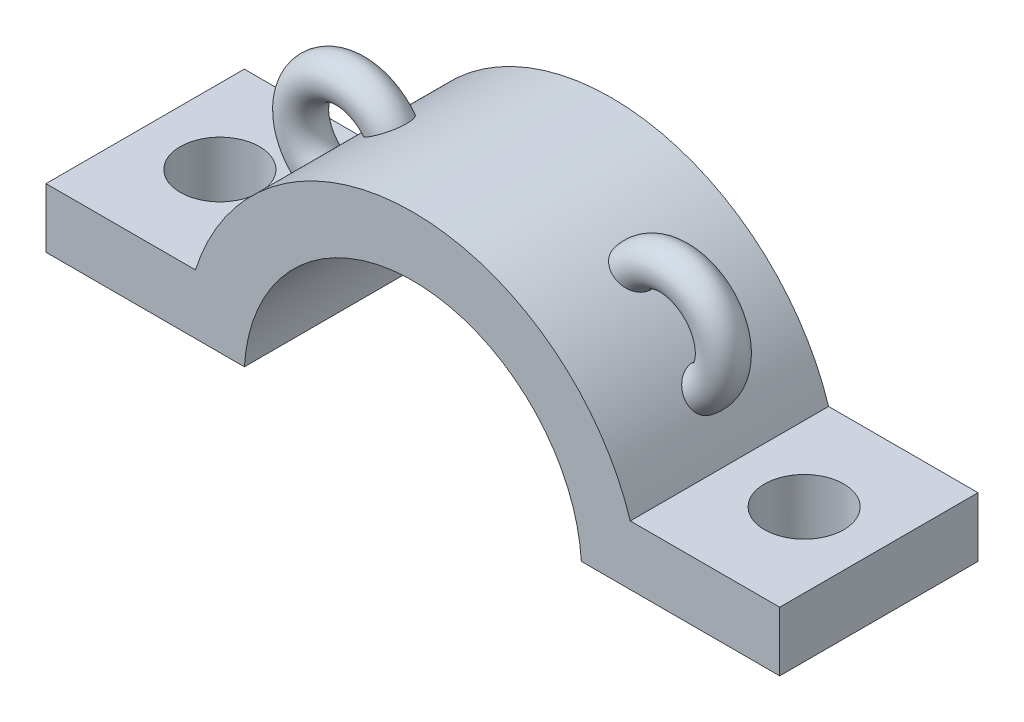
ISO-10303-21;
HEADER;
FILE_DESCRIPTION(('STEP AP214'),'2;1');
FILE_NAME('part.step','',(''),(''),'','','');
FILE_SCHEMA(('AUTOMOTIVE_DESIGN { 1 0 10303 214 1 1 1 1 }'));
ENDSEC;
DATA;
#1=APPLICATION_CONTEXT('core data for automotive mechanical design processes');
#2=APPLICATION_PROTOCOL_DEFINITION('international standard','automotive_design',2000,#1);
#3=PRODUCT_CONTEXT('',#1,'mechanical');
#4=PRODUCT('Part','Part','',(#3));
#5=PRODUCT_RELATED_PRODUCT_CATEGORY('part','',(#4));
#6=PRODUCT_DEFINITION_FORMATION('','',#4);
#7=PRODUCT_DEFINITION_CONTEXT('part definition',#1,'design');
#8=PRODUCT_DEFINITION('design','',#6,#7);
#9=PRODUCT_DEFINITION_SHAPE('','',#8);
#10=(LENGTH_UNIT() NAMED_UNIT(*) SI_UNIT(.MILLI.,.METRE.));
#11=(NAMED_UNIT(*) PLANE_ANGLE_UNIT() SI_UNIT($,.RADIAN.));
#12=(NAMED_UNIT(*) SI_UNIT($,.STERADIAN.) SOLID_ANGLE_UNIT());
#13=UNCERTAINTY_MEASURE_WITH_UNIT(LENGTH_MEASURE(1.E-05),#10,'distance_accuracy_value','');
#14=(GEOMETRIC_REPRESENTATION_CONTEXT(3) GLOBAL_UNCERTAINTY_ASSIGNED_CONTEXT((#13)) GLOBAL_UNIT_ASSIGNED_CONTEXT((#10,
#11,#12)) REPRESENTATION_CONTEXT('',''));
#15=CARTESIAN_POINT('',(0.,0.,0.));
#16=DIRECTION('',(0.,0.,1.));
#17=DIRECTION('',(1.,0.,0.));
#18=AXIS2_PLACEMENT_3D('',#15,#16,#17);
#19=CARTESIAN_POINT('',(-8.16001225489276,8.16001225489276,5.));
#20=DIRECTION('',(0.,0.,1.));
#21=DIRECTION('',(1.,0.,0.));
#22=AXIS2_PLACEMENT_3D('',#19,#20,#21);
#23=TOROIDAL_SURFACE('',#22,2.5,1.);
#24=CARTESIAN_POINT('',(-6.89794310127608,9.21403716030539,4.48249529258728));
#25=CARTESIAN_POINT('',(-6.87466553189521,9.23146355470979,4.43448846411034));
#26=CARTESIAN_POINT('',(-6.84806054537289,9.2512442682936,4.38890504461064));
#27=CARTESIAN_POINT('',(-6.7888358033246,9.29479191155577,4.30391489903348));
#28=CARTESIAN_POINT('',(-6.75620934317056,9.31856328194971,4.26451514957194));
#29=CARTESIAN_POINT('',(-6.68578093585331,9.3692214273912,4.19305984630933));
#30=CARTESIAN_POINT('',(-6.64798144268979,9.39610672432062,4.16100082935032));
#31=CARTESIAN_POINT('',(-6.56817537327642,9.45206557480704,4.10511083504705));
#32=CARTESIAN_POINT('',(-6.52616976891462,9.48113862246582,4.08127796255694));
#33=CARTESIAN_POINT('',(-6.43901811038122,9.54054119957915,4.04246686885715));
#34=CARTESIAN_POINT('',(-6.39386973307894,9.5708716516604,4.02749527726055));
#35=CARTESIAN_POINT('',(-6.3016815296259,9.6318202985885,4.00683124633167));
#36=CARTESIAN_POINT('',(-6.25464160531715,9.66243850830461,4.00113928918556));
#37=CARTESIAN_POINT('',(-6.15982910643749,9.72315709707974,3.99916723843869));
#38=CARTESIAN_POINT('',(-6.11205472014281,9.75325558852876,4.00291621725756));
#39=CARTESIAN_POINT('',(-6.01727530370843,9.81201346591203,4.01976237576921));
#40=CARTESIAN_POINT('',(-5.97027029501635,9.84067281177375,4.03285981561247));
#41=CARTESIAN_POINT('',(-5.87819348821499,9.89595065960183,4.06810682239178));
#42=CARTESIAN_POINT('',(-5.83313115614424,9.9225595782669,4.090296155035));
#43=CARTESIAN_POINT('',(-5.74651586488214,9.97297195193954,4.14311015310339));
#44=CARTESIAN_POINT('',(-5.70496296787408,9.99677535723947,4.17373496795499));
#45=CARTESIAN_POINT('',(-5.62657856843251,10.0411029344048,4.24263893343624));
#46=CARTESIAN_POINT('',(-5.5897558614646,10.0616210143974,4.28093201394468));
#47=CARTESIAN_POINT('',(-5.52210071101527,10.098910811796,4.3640746335271));
#48=CARTESIAN_POINT('',(-5.49126815826524,10.1156825975404,4.40892405297833));
#49=CARTESIAN_POINT('',(-5.43673208325811,10.1450975134998,4.50371364444149));
#50=CARTESIAN_POINT('',(-5.41299824281107,10.1577582223419,4.55363091060698));
#51=CARTESIAN_POINT('',(-5.37328569991433,10.1788215960906,4.65730154160586));
#52=CARTESIAN_POINT('',(-5.35730658114205,10.1872244895848,4.71105470032646));
#53=CARTESIAN_POINT('',(-5.33376086755532,10.1995721394146,4.82037258235374));
#54=CARTESIAN_POINT('',(-5.32612263191114,10.203554866007,4.87591759073192));
#55=CARTESIAN_POINT('',(-5.31927835510159,10.2071246384065,4.98766356938003));
#56=CARTESIAN_POINT('',(-5.32007196644634,10.2067118653593,5.0438645125225));
#57=CARTESIAN_POINT('',(-5.33003322412093,10.2015134235693,5.15497799273184));
#58=CARTESIAN_POINT('',(-5.33915162223277,10.1967534720397,5.2098961611241));
#59=CARTESIAN_POINT('',(-5.36537982395347,10.1829768137772,5.31723209558328));
#60=CARTESIAN_POINT('',(-5.38248967368232,10.1739600824777,5.36964984721796));
#61=CARTESIAN_POINT('',(-5.42417144661045,10.1517988312907,5.47063515926183));
#62=CARTESIAN_POINT('',(-5.44876000034407,10.1386451096575,5.51919383149009));
#63=CARTESIAN_POINT('',(-5.50457706099111,10.1084486873159,5.61099397972652));
#64=CARTESIAN_POINT('',(-5.53580586001474,10.0914058155179,5.65423522168415));
#65=CARTESIAN_POINT('',(-5.60419041970007,10.0535906582702,5.73455808556626));
#66=CARTESIAN_POINT('',(-5.64139294308348,10.0327887710014,5.77158595920475));
#67=CARTESIAN_POINT('',(-5.7203723291041,9.9879677057349,5.83803536941624));
#68=CARTESIAN_POINT('',(-5.76214939052894,9.96394838791282,5.86745657525282));
#69=CARTESIAN_POINT('',(-5.8493192650552,9.91302813625339,5.91807046164336));
#70=CARTESIAN_POINT('',(-5.89473571528774,9.88610789383988,5.93920303256803));
#71=CARTESIAN_POINT('',(-5.98755982474238,9.83016590978966,5.97234714529814));
#72=CARTESIAN_POINT('',(-6.03496750617645,9.80114414470809,5.9843585853299));
#73=CARTESIAN_POINT('',(-6.13043835483489,9.74171389187766,5.99891887291461));
#74=CARTESIAN_POINT('',(-6.17850218400145,9.71130391799878,6.00145732683758));
#75=CARTESIAN_POINT('',(-6.27385216560373,9.64997886883826,5.99694904010165));
#76=CARTESIAN_POINT('',(-6.32113833382711,9.61906380383618,5.98990249427611));
#77=CARTESIAN_POINT('',(-6.41343215373392,9.55777416614003,5.96644343759904));
#78=CARTESIAN_POINT('',(-6.4584475777945,9.5273980185958,5.95006562461854));
#79=CARTESIAN_POINT('',(-6.54515814895695,9.46803927839301,5.90841198565526));
#80=CARTESIAN_POINT('',(-6.5868533675939,9.43905665571575,5.88313635144303));
#81=CARTESIAN_POINT('',(-6.66565444596636,9.383574315023,5.82451129951833));
#82=CARTESIAN_POINT('',(-6.70277833883111,9.35706494782758,5.79119524869675));
#83=CARTESIAN_POINT('',(-6.77168443228446,9.30731966650592,5.71737144932331));
#84=CARTESIAN_POINT('',(-6.80346668304719,9.2840837216327,5.67686376832989));
#85=CARTESIAN_POINT('',(-6.86084599220993,9.24176198383478,5.5898877198648));
#86=CARTESIAN_POINT('',(-6.88645470932117,9.22266837504943,5.5434308456894));
#87=CARTESIAN_POINT('',(-6.9309500064993,9.189276848756,5.44581475890151));
#88=CARTESIAN_POINT('',(-6.94983683444528,9.17497875440772,5.39465571977553));
#89=CARTESIAN_POINT('',(-6.98044265955437,9.15171525235025,5.28910594841128));
#90=CARTESIAN_POINT('',(-6.99216424210352,9.14274792121074,5.23471638960034));
#91=CARTESIAN_POINT('',(-7.00818302935818,9.13047500961941,5.12421766297088));
#92=CARTESIAN_POINT('',(-7.01247851589814,9.12717073942369,5.0681081002528));
#93=CARTESIAN_POINT('',(-7.01354489535417,9.12635131158853,4.95574890586398));
#94=CARTESIAN_POINT('',(-7.01031159132405,9.12883938290657,4.89949921353732));
#95=CARTESIAN_POINT('',(-6.99638442435643,9.13951759721157,4.78852878143078));
#96=CARTESIAN_POINT('',(-6.98569894187068,9.14770133503563,4.7338063959197));
#97=CARTESIAN_POINT('',(-6.96214218069013,9.16563185967271,4.6460520638227));
#98=CARTESIAN_POINT('',(-6.95134098441737,9.17383202703028,4.61212522702007));
#99=CARTESIAN_POINT('',(-6.92680990676224,9.19236866460352,4.54595576740867));
#100=CARTESIAN_POINT('',(-6.91308002533144,9.20270513485453,4.51371314462777));
#101=CARTESIAN_POINT('',(-6.89794310127608,9.21403716030539,4.48249529258728));
#102=B_SPLINE_CURVE_WITH_KNOTS('',3,(#24,#25,#26,#27,#28,#29,#30,#31,#32,#33,#34,#35,#36,#37,
#38,#39,#40,#41,#42,#43,#44,#45,#46,#47,#48,#49,#50,#51,#52,#53,#54,#55,#56,#57,#58,#59,#60,#61,
#62,#63,#64,#65,#66,#67,#68,#69,#70,#71,#72,#73,#74,#75,#76,#77,#78,#79,#80,#81,#82,#83,#84,#85,
#86,#87,#88,#89,#90,#91,#92,#93,#94,#95,#96,#97,#98,#99,#100,#101),.UNSPECIFIED.,.T.,.F.,(4,2,2,
2,2,2,2,2,2,2,2,2,2,2,2,2,2,2,2,2,2,2,2,2,2,2,2,2,2,2,2,2,2,2,2,2,2,2,4),(0.,0.168246428802445,
0.336681334855758,0.505036613422666,0.673353080235135,0.84179531522386,1.01024630248896,
1.17921665165956,1.34819170314775,1.51791383580606,1.68763897512156,1.85767527411553,
2.02770847112374,2.19700474136264,2.3662919216994,2.53411335105104,2.70192786424032,
2.8687559993447,3.03558509725378,3.20278792261495,3.36999810489715,3.53858748687297,
3.70718419784942,3.87698192255409,4.04678154183557,4.2167674082395,4.38674981940891,
4.55610424621515,4.72545502322816,4.89411474464046,5.06277288174061,5.2311099682146,
5.39944084637885,5.56771095096745,5.73601998276971,5.9044228613912,6.07263666492646,
6.18204385137205,6.2914510396269),.UNSPECIFIED.);
#103=CARTESIAN_POINT('',(-6.89794310127608,9.21403716030539,4.48249529258728));
#104=VERTEX_POINT('',#103);
#105=EDGE_CURVE('E11',#104,#104,#102,.T.);
#106=ORIENTED_EDGE('',*,*,#105,.F.);
#107=EDGE_LOOP('',(#106));
#108=FACE_BOUND('',#107,.T.);
#109=CARTESIAN_POINT('',(-10.1484253906957,5.43042927304,4.5195855854331));
#110=CARTESIAN_POINT('',(-10.1611576984264,5.40663552622533,4.56838620972798));
#111=CARTESIAN_POINT('',(-10.1718820241138,5.38639530298285,4.61948427058422));
#112=CARTESIAN_POINT('',(-10.1891139301371,5.35372777737049,4.72483597757117));
#113=CARTESIAN_POINT('',(-10.1956172272907,5.34130841139769,4.77909276831689));
#114=CARTESIAN_POINT('',(-10.2042847167935,5.32473118496674,4.88918605848974));
#115=CARTESIAN_POINT('',(-10.2064498003431,5.32057162769544,4.9450222310734));
#116=CARTESIAN_POINT('',(-10.2064054667467,5.32065667764962,5.05667323371785));
#117=CARTESIAN_POINT('',(-10.2041970055122,5.32489944840536,5.11248806577609));
#118=CARTESIAN_POINT('',(-10.1954575839893,5.34161322622999,5.22235949279557));
#119=CARTESIAN_POINT('',(-10.1889389411484,5.3540607856995,5.27642063886006));
#120=CARTESIAN_POINT('',(-10.1717009170991,5.38673734893169,5.38143248443744));
#121=CARTESIAN_POINT('',(-10.1609813338134,5.40696672702119,5.43238303418549));
#122=CARTESIAN_POINT('',(-10.1354766622465,5.45462582656878,5.52994958796923));
#123=CARTESIAN_POINT('',(-10.1206759467039,5.48208320642596,5.5765479897399));
#124=CARTESIAN_POINT('',(-10.0872939371684,5.54326727210663,5.66390881379737));
#125=CARTESIAN_POINT('',(-10.0687124698137,5.57699424540847,5.70467096832418));
#126=CARTESIAN_POINT('',(-10.0279460574829,5.64996955168055,5.77957911588246));
#127=CARTESIAN_POINT('',(-10.0057313767663,5.68926305463153,5.81366492739354));
#128=CARTESIAN_POINT('',(-9.9582733584305,5.7719286344534,5.87384675149541));
#129=CARTESIAN_POINT('',(-9.93302990861563,5.81530086240104,5.89994246797907));
#130=CARTESIAN_POINT('',(-9.87991575960772,5.90509094045701,5.94356053363371));
#131=CARTESIAN_POINT('',(-9.8520299779555,5.95152575014796,5.96102963131506));
#132=CARTESIAN_POINT('',(-9.79444757806999,6.04582060814263,5.98665897451218));
#133=CARTESIAN_POINT('',(-9.76475095252665,6.0936806621994,5.99481918244704));
#134=CARTESIAN_POINT('',(-9.70434442097972,6.18942665385059,6.00158374589894));
#135=CARTESIAN_POINT('',(-9.673634688814,6.23731258563189,6.00018973241425));
#136=CARTESIAN_POINT('',(-9.61208403305143,6.33175473780626,5.98786506234859));
#137=CARTESIAN_POINT('',(-9.58124311244915,6.37831098836618,5.97693462230093));
#138=CARTESIAN_POINT('',(-9.5205108773747,6.4686106096102,5.94588835414655));
#139=CARTESIAN_POINT('',(-9.4906161664219,6.51236480568176,5.92581065691329));
#140=CARTESIAN_POINT('',(-9.43261864422242,6.59608988211781,5.8770311299035));
#141=CARTESIAN_POINT('',(-9.40451579478919,6.63606084311602,5.84832948398734));
#142=CARTESIAN_POINT('',(-9.35116389493052,6.71103170086571,5.78322825856977));
#143=CARTESIAN_POINT('',(-9.32590459566992,6.74604957501608,5.74685777719251));
#144=CARTESIAN_POINT('',(-9.27901114707364,6.81040682803996,5.66737980322774));
#145=CARTESIAN_POINT('',(-9.25737696745812,6.83974625434467,5.62427236691841));
#146=CARTESIAN_POINT('',(-9.21854856047077,6.89198982955535,5.53261102087402));
#147=CARTESIAN_POINT('',(-9.20134783715866,6.91490339807335,5.48406523093124));
#148=CARTESIAN_POINT('',(-9.17198074602423,6.95380947581621,5.38285242325883));
#149=CARTESIAN_POINT('',(-9.15981437788692,6.96980198547411,5.33018540578704));
#150=CARTESIAN_POINT('',(-9.14097341157887,6.99449414016455,5.22223086973062));
#151=CARTESIAN_POINT('',(-9.13429825512041,7.00319452658395,5.16694361814801));
#152=CARTESIAN_POINT('',(-9.12669005846343,7.01310690481495,5.05531278440995));
#153=CARTESIAN_POINT('',(-9.1257570231786,7.01431889021852,4.99896920135061));
#154=CARTESIAN_POINT('',(-9.1296686969729,7.00922673048459,4.88681899824569));
#155=CARTESIAN_POINT('',(-9.13451400144844,7.00292181081004,4.83101243413153));
#156=CARTESIAN_POINT('',(-9.14979976745872,6.98293783401347,4.72152642583099));
#157=CARTESIAN_POINT('',(-9.16024022673603,6.96925877986664,4.66784698078641));
#158=CARTESIAN_POINT('',(-9.1863231550839,6.93484176914233,4.56413996585747));
#159=CARTESIAN_POINT('',(-9.20196554092484,6.91410392550371,4.51411233756052));
#160=CARTESIAN_POINT('',(-9.2378706774736,6.86605718539231,4.41912776835813));
#161=CARTESIAN_POINT('',(-9.25813340651185,6.83874831973782,4.37417080367258));
#162=CARTESIAN_POINT('',(-9.30253705455312,6.77822315106501,4.29060507750717));
#163=CARTESIAN_POINT('',(-9.32667752492508,6.74500753137465,4.251995582708));
#164=CARTESIAN_POINT('',(-9.37797986926314,6.6734943137691,4.18220561655376));
#165=CARTESIAN_POINT('',(-9.40514174027248,6.63519672082717,4.15102513792869));
#166=CARTESIAN_POINT('',(-9.46156301446096,6.55449060283366,4.09695322155081));
#167=CARTESIAN_POINT('',(-9.49082307026516,6.51208079725105,4.07406437636471));
#168=CARTESIAN_POINT('',(-9.55047220550426,6.42428168303644,4.03721483806877));
#169=CARTESIAN_POINT('',(-9.58086129665523,6.37889234348189,4.02325423763524));
#170=CARTESIAN_POINT('',(-9.64188760521241,6.2862695056077,4.00460967397817));
#171=CARTESIAN_POINT('',(-9.67252520584411,6.23903238682703,3.99994495935631));
#172=CARTESIAN_POINT('',(-9.73309135797815,6.14411930318721,4.00005602490396));
#173=CARTESIAN_POINT('',(-9.76301991661669,6.09644334275153,4.00483171001917));
#174=CARTESIAN_POINT('',(-9.8214775665845,6.00181514309027,4.02370931361701));
#175=CARTESIAN_POINT('',(-9.85000047940562,5.95486663030363,4.0378490367747));
#176=CARTESIAN_POINT('',(-9.9048058807259,5.86325613412455,4.07509403979527));
#177=CARTESIAN_POINT('',(-9.9310877963716,5.81859473653288,4.09820160372638));
#178=CARTESIAN_POINT('',(-9.9808938635102,5.73274226156757,4.15284610788132));
#179=CARTESIAN_POINT('',(-10.0044065142202,5.69156584352944,4.18441653257315));
#180=CARTESIAN_POINT('',(-10.0480276317249,5.61419750219021,4.25505149830074));
#181=CARTESIAN_POINT('',(-10.0681398426465,5.57800010493112,4.29410769448739));
#182=CARTESIAN_POINT('',(-10.0984175890426,5.52292424274644,4.36432393886863));
#183=CARTESIAN_POINT('',(-10.1096493600414,5.50232347527487,4.39370090000723));
#184=CARTESIAN_POINT('',(-10.130366095041,5.46408771439542,4.45489980247763));
#185=CARTESIAN_POINT('',(-10.1398510619365,5.44645271607287,4.48672173975767));
#186=CARTESIAN_POINT('',(-10.1484253906957,5.43042927304,4.5195855854331));
#187=B_SPLINE_CURVE_WITH_KNOTS('',3,(#109,#110,#111,#112,#113,#114,#115,#116,#117,#118,#119,
#120,#121,#122,#123,#124,#125,#126,#127,#128,#129,#130,#131,#132,#133,#134,#135,#136,#137,#138,
#139,#140,#141,#142,#143,#144,#145,#146,#147,#148,#149,#150,#151,#152,#153,#154,#155,#156,#157,
#158,#159,#160,#161,#162,#163,#164,#165,#166,#167,#168,#169,#170,#171,#172,#173,#174,#175,#176,
#177,#178,#179,#180,#181,#182,#183,#184,#185,#186),.UNSPECIFIED.,.T.,.F.,(4,2,2,2,2,2,2,2,2,2,2,
2,2,2,2,2,2,2,2,2,2,2,2,2,2,2,2,2,2,2,2,2,2,2,2,2,2,2,4),(0.,0.167160066347432,
0.334489490070472,0.501784535739529,0.669043020305533,0.835825574911327,1.00261615321889,
1.17005448538669,1.33750049696346,1.50639267038198,1.67529110206454,1.84521948988464,
2.01514856371999,2.18504862973679,2.35494483811717,2.52413921431496,2.69332998358788,
2.86188998117347,3.0304485707426,3.19875876446961,3.367068947666,3.53536201676644,
3.70365522988002,3.87196578531643,4.04027627284606,4.20858406757683,4.37689107295446,
4.54517862024202,4.71346600284358,4.88180595897711,5.05014766247238,5.21883758338722,
5.38752580579125,5.55689924544282,5.72631585207972,5.8964129339912,6.06632148963621,
6.17889242098189,6.29146316578105),.UNSPECIFIED.);
#188=CARTESIAN_POINT('',(-10.1484253906957,5.43042927304,4.5195855854331));
#189=VERTEX_POINT('',#188);
#190=EDGE_CURVE('E51',#189,#189,#187,.T.);
#191=ORIENTED_EDGE('',*,*,#190,.T.);
#192=EDGE_LOOP('',(#191));
#193=FACE_BOUND('',#192,.T.);
#194=ADVANCED_FACE('F42',(#108,#193),#23,.T.);
#195=CARTESIAN_POINT('',(0.,0.,10.));
#196=DIRECTION('',(0.,0.,-1.));
#197=DIRECTION('',(-1.,0.,0.));
#198=AXIS2_PLACEMENT_3D('',#195,#196,#197);
#199=CYLINDRICAL_SURFACE('',#198,11.51);
#200=ORIENTED_EDGE('',*,*,#105,.T.);
#201=EDGE_LOOP('',(#200));
#202=FACE_BOUND('',#201,.T.);
#203=ADVANCED_FACE('F65',(#202),#199,.F.);
#204=CARTESIAN_POINT('',(0.,0.,10.));
#205=DIRECTION('',(0.,0.,-1.));
#206=DIRECTION('',(-1.,0.,0.));
#207=AXIS2_PLACEMENT_3D('',#204,#205,#206);
#208=CYLINDRICAL_SURFACE('',#207,11.51);
#209=ORIENTED_EDGE('',*,*,#190,.F.);
#210=EDGE_LOOP('',(#209));
#211=FACE_BOUND('',#210,.T.);
#212=ADVANCED_FACE('F62',(#211),#208,.F.);
#213=CLOSED_SHELL('',(#194,#203,#212));
#214=MANIFOLD_SOLID_BREP('B2',#213);
#215=CARTESIAN_POINT('',(0.,0.,10.));
#216=DIRECTION('',(0.,0.,-1.));
#217=DIRECTION('',(-1.,0.,0.));
#218=AXIS2_PLACEMENT_3D('',#215,#216,#217);
#219=CYLINDRICAL_SURFACE('',#218,11.51);
#220=CARTESIAN_POINT('',(5.79466484099146,9.94494642650784,4.11377304347057));
#221=CARTESIAN_POINT('',(5.75132909336595,9.97019672531996,4.13980803273631));
#222=CARTESIAN_POINT('',(5.70968703284886,9.99407838753372,4.1700714228735));
#223=CARTESIAN_POINT('',(5.63110190800396,10.0385676241114,4.23822719987705));
#224=CARTESIAN_POINT('',(5.59416409401686,10.0591715465153,4.27612799104503));
#225=CARTESIAN_POINT('',(5.5262017594559,10.0966678873592,4.35849418861376));
#226=CARTESIAN_POINT('',(5.49517619535309,10.1135609608552,4.40295843408291));
#227=CARTESIAN_POINT('',(5.44006262704099,10.143313227818,4.49720198205219));
#228=CARTESIAN_POINT('',(5.4159728348614,10.1561734609857,4.54697991019603));
#229=CARTESIAN_POINT('',(5.37564362049291,10.1775771587524,4.6501738839102));
#230=CARTESIAN_POINT('',(5.35936340312567,10.1861430666191,4.70356932327693));
#231=CARTESIAN_POINT('',(5.33502688573689,10.1989106825749,4.81270634520208));
#232=CARTESIAN_POINT('',(5.32697046458903,10.2031124549423,4.86844789319263));
#233=CARTESIAN_POINT('',(5.31939574083626,10.2070636005512,4.98019604729435));
#234=CARTESIAN_POINT('',(5.31980694521292,10.2068497339663,5.03619658763424));
#235=CARTESIAN_POINT('',(5.32897981835308,10.2020635264073,5.14731926721061));
#236=CARTESIAN_POINT('',(5.3377412943253,10.1974912860595,5.20244142669731));
#237=CARTESIAN_POINT('',(5.36328308138075,10.1840807171303,5.31011952437395));
#238=CARTESIAN_POINT('',(5.38004524749723,10.1752520413717,5.36268097425506));
#239=CARTESIAN_POINT('',(5.42101579719613,10.15348329344,5.46390459584473));
#240=CARTESIAN_POINT('',(5.4452243751616,10.1405431139389,5.51256666572107));
#241=CARTESIAN_POINT('',(5.50045488883077,10.1106915507062,5.60492407468452));
#242=CARTESIAN_POINT('',(5.53151572840186,10.0937574518602,5.64858879968113));
#243=CARTESIAN_POINT('',(5.59937037254007,10.0562741761447,5.72943002558807));
#244=CARTESIAN_POINT('',(5.63616446436727,10.0357248181289,5.76660620119679));
#245=CARTESIAN_POINT('',(5.71468038238548,9.9912250582563,5.83375412247332));
#246=CARTESIAN_POINT('',(5.75644200746836,9.96724682672134,5.86366090164871));
#247=CARTESIAN_POINT('',(5.84335467148962,9.91654348115203,5.91502996769317));
#248=CARTESIAN_POINT('',(5.88850581123443,9.8898182854124,5.93649200329136));
#249=CARTESIAN_POINT('',(5.98105863364268,9.834122495412,5.97045075678064));
#250=CARTESIAN_POINT('',(6.02846950717192,9.80514236224676,5.98290680667993));
#251=CARTESIAN_POINT('',(6.12395824689951,9.74578855375234,5.99833294242664));
#252=CARTESIAN_POINT('',(6.17203610906762,9.71541488684094,6.00130308556713));
#253=CARTESIAN_POINT('',(6.26739584325798,9.65417294335488,5.99765552032066));
#254=CARTESIAN_POINT('',(6.31467891093634,9.62330557789734,5.99105382194839));
#255=CARTESIAN_POINT('',(6.40720290288382,9.5619523853236,5.96845346889025));
#256=CARTESIAN_POINT('',(6.45244387726596,9.53146654885794,5.95245504493539));
#257=CARTESIAN_POINT('',(6.53945055211314,9.47198258978539,5.91158495085561));
#258=CARTESIAN_POINT('',(6.5812306750806,9.44297850860498,5.8867526537254));
#259=CARTESIAN_POINT('',(6.66042995076635,9.38728500179722,5.82889107344544));
#260=CARTESIAN_POINT('',(6.69784918241912,9.36059553427636,5.79586193869671));
#261=CARTESIAN_POINT('',(6.76725450305798,9.3105421582324,5.72265312251304));
#262=CARTESIAN_POINT('',(6.7992573244928,9.28716804549965,5.6824962779417));
#263=CARTESIAN_POINT('',(6.85717986479398,9.24448388567109,5.59609669986381));
#264=CARTESIAN_POINT('',(6.88309961612743,9.22517381688437,5.54985399884129));
#265=CARTESIAN_POINT('',(6.92821076925405,9.19134337375066,5.45264193983427));
#266=CARTESIAN_POINT('',(6.94740857661222,9.1768184402731,5.40167714059915));
#267=CARTESIAN_POINT('',(6.9786613710149,9.15307451680843,5.29642941522814));
#268=CARTESIAN_POINT('',(6.99071635047715,9.1438555324537,5.24214648557007));
#269=CARTESIAN_POINT('',(7.00740720633061,9.13107092125437,5.13180151879291));
#270=CARTESIAN_POINT('',(7.01204283262734,9.12750548498184,5.07573942176591));
#271=CARTESIAN_POINT('',(7.01378905673625,9.12616373016513,4.96342908639084));
#272=CARTESIAN_POINT('',(7.01089965663028,9.12838741001936,4.90718084809426));
#273=CARTESIAN_POINT('',(6.99766078086059,9.13853993064176,4.79609037243636));
#274=CARTESIAN_POINT('',(6.98731072947644,9.14646921169731,4.74124824391936));
#275=CARTESIAN_POINT('',(6.95938652934772,9.16773389887242,4.63453147643996));
#276=CARTESIAN_POINT('',(6.94181238006358,9.18106930539576,4.58265683769919));
#277=CARTESIAN_POINT('',(6.8998501608452,9.21264641775144,4.48335030886419));
#278=CARTESIAN_POINT('',(6.87546246313862,9.23088785556275,4.43591817626254));
#279=CARTESIAN_POINT('',(6.82045468551606,9.2716053131989,4.34683820283039));
#280=CARTESIAN_POINT('',(6.78983461991587,9.29408132329691,4.30519034871374));
#281=CARTESIAN_POINT('',(6.72311693321904,9.34245645396211,4.22885796380358));
#282=CARTESIAN_POINT('',(6.6870197157486,9.36835532227147,4.1941729203388));
#283=CARTESIAN_POINT('',(6.61026202203093,9.42267174887568,4.13273522297597));
#284=CARTESIAN_POINT('',(6.56960171310841,9.45108921480765,4.10598227834548));
#285=CARTESIAN_POINT('',(6.48475470704128,9.50950619919884,4.06113281970275));
#286=CARTESIAN_POINT('',(6.44056607451495,9.53950658282875,4.04304109519775));
#287=CARTESIAN_POINT('',(6.34985580451394,9.60012528812507,4.01601985638951));
#288=CARTESIAN_POINT('',(6.30333360797538,9.63074375680924,4.00709254875499));
#289=CARTESIAN_POINT('',(6.20910213306857,9.6917651864867,3.99861705589494));
#290=CARTESIAN_POINT('',(6.1613895923978,9.72216717183374,3.99909834121806));
#291=CARTESIAN_POINT('',(6.06629826283586,9.78178242118173,4.00947963120654));
#292=CARTESIAN_POINT('',(6.01891917086249,9.8109969251893,4.01936953312926));
#293=CARTESIAN_POINT('',(5.94179617163994,9.85781153900653,4.0432942088822));
#294=CARTESIAN_POINT('',(5.91156421858862,9.87596585437654,4.05475353752309));
#295=CARTESIAN_POINT('',(5.85220058322903,9.91125824826266,4.08146073723684));
#296=CARTESIAN_POINT('',(5.8230689046879,9.92839632329947,4.09670862127966));
#297=CARTESIAN_POINT('',(5.79466484099146,9.94494642650784,4.11377304347057));
#298=B_SPLINE_CURVE_WITH_KNOTS('',3,(#220,#221,#222,#223,#224,#225,#226,#227,#228,#229,#230,
#231,#232,#233,#234,#235,#236,#237,#238,#239,#240,#241,#242,#243,#244,#245,#246,#247,#248,#249,
#250,#251,#252,#253,#254,#255,#256,#257,#258,#259,#260,#261,#262,#263,#264,#265,#266,#267,#268,
#269,#270,#271,#272,#273,#274,#275,#276,#277,#278,#279,#280,#281,#282,#283,#284,#285,#286,#287,
#288,#289,#290,#291,#292,#293,#294,#295,#296,#297),.UNSPECIFIED.,.T.,.F.,(4,2,2,2,2,2,2,2,2,2,2,
2,2,2,2,2,2,2,2,2,2,2,2,2,2,2,2,2,2,2,2,2,2,2,2,2,2,2,4),(0.,0.16939613412756,0.338979702153781,
0.508533310416767,0.678043170295869,0.846657642992711,1.01526963217147,1.18247849760436,
1.34968350260841,1.51651108805877,1.68334302878847,1.85114772272095,2.0189608270799,
2.18822266105155,2.35748953097897,2.52751605868823,2.69754155946785,2.86728300074647,
3.0370202742992,3.2060103087504,3.37499728391616,3.54345229664801,3.71190641026628,
3.88019955863323,4.04849288564623,4.21679188543743,4.38509083866764,4.55340278051181,
4.72171473492735,4.89001749617205,5.05831987082885,5.22660984884489,5.39489365782443,
5.56327041770128,5.7316877109414,5.90063262218957,6.06939632903423,6.18042526876822,
6.2914545886099),.UNSPECIFIED.);
#299=CARTESIAN_POINT('',(5.79466484099146,9.94494642650784,4.11377304347057));
#300=VERTEX_POINT('',#299);
#301=EDGE_CURVE('E104',#300,#300,#298,.T.);
#302=ORIENTED_EDGE('',*,*,#301,.F.);
#303=EDGE_LOOP('',(#302));
#304=FACE_BOUND('',#303,.T.);
#305=CARTESIAN_POINT('',(0.,0.,0.));
#306=DIRECTION('',(0.,0.,1.));
#307=DIRECTION('',(1.,0.,0.));
#308=AXIS2_PLACEMENT_3D('',#305,#306,#307);
#309=CIRCLE('',#308,11.51);
#310=CARTESIAN_POINT('',(10.964898554331,3.5001570955073,0.));
#311=VERTEX_POINT('',#310);
#312=CARTESIAN_POINT('',(-10.964898554331,3.50015709550731,0.));
#313=VERTEX_POINT('',#312);
#314=EDGE_CURVE('E147',#311,#313,#309,.T.);
#315=ORIENTED_EDGE('',*,*,#314,.T.);
#316=DIRECTION('',(0.,0.,-1.));
#317=VECTOR('',#316,1.);
#318=CARTESIAN_POINT('',(-10.964898554331,3.50015709550731,10.));
#319=LINE('',#318,#317);
#320=CARTESIAN_POINT('',(-10.964898554331,3.50015709550731,10.));
#321=VERTEX_POINT('',#320);
#322=EDGE_CURVE('E190',#321,#313,#319,.T.);
#323=ORIENTED_EDGE('',*,*,#322,.F.);
#324=CARTESIAN_POINT('',(0.,0.,10.));
#325=DIRECTION('',(0.,0.,1.));
#326=DIRECTION('',(1.,0.,0.));
#327=AXIS2_PLACEMENT_3D('',#324,#325,#326);
#328=CIRCLE('',#327,11.51);
#329=CARTESIAN_POINT('',(10.964898554331,3.5001570955073,10.));
#330=VERTEX_POINT('',#329);
#331=EDGE_CURVE('E112',#330,#321,#328,.T.);
#332=ORIENTED_EDGE('',*,*,#331,.F.);
#333=DIRECTION('',(0.,0.,-1.));
#334=VECTOR('',#333,1.);
#335=CARTESIAN_POINT('',(10.964898554331,3.5001570955073,10.));
#336=LINE('',#335,#334);
#337=EDGE_CURVE('E185',#330,#311,#336,.T.);
#338=ORIENTED_EDGE('',*,*,#337,.T.);
#339=EDGE_LOOP('',(#315,#323,#332,#338));
#340=FACE_BOUND('',#339,.T.);
#341=CARTESIAN_POINT('',(9.40299971739691,6.63804913469564,4.15512142607273));
#342=CARTESIAN_POINT('',(9.37563522848132,6.67681142357298,4.18509356415304));
#343=CARTESIAN_POINT('',(9.34946786008661,6.71336643676179,4.21908360965708));
#344=CARTESIAN_POINT('',(9.30045841351401,6.78110094883774,4.29414937083745));
#345=CARTESIAN_POINT('',(9.27762003303104,6.81227447718127,4.33523285664407));
#346=CARTESIAN_POINT('',(9.23612110580889,6.8684341682837,4.42329023089336));
#347=CARTESIAN_POINT('',(9.21745877496096,6.89342297379057,4.47026159046201));
#348=CARTESIAN_POINT('',(9.18499310615928,6.93662275144479,4.56876269193994));
#349=CARTESIAN_POINT('',(9.17118868903312,6.95483522898667,4.62029141825577));
#350=CARTESIAN_POINT('',(9.14894938442371,6.98406504933309,4.72644801677405));
#351=CARTESIAN_POINT('',(9.14051385386175,6.99508325386302,4.78107551695513));
#352=CARTESIAN_POINT('',(9.12932809269576,7.00967576778982,4.89188661186286));
#353=CARTESIAN_POINT('',(9.12657806225685,7.0132498151059,4.94807026130512));
#354=CARTESIAN_POINT('',(9.12686814748331,7.01287229573125,5.06040263621894));
#355=CARTESIAN_POINT('',(9.12990880830937,7.00892002048003,5.11655135790443));
#356=CARTESIAN_POINT('',(9.14166604119274,6.99357806104616,5.22721459785139));
#357=CARTESIAN_POINT('',(9.15038260332549,6.98218838986812,5.28172911897016));
#358=CARTESIAN_POINT('',(9.17316277838018,6.95223246801261,5.38757678075656));
#359=CARTESIAN_POINT('',(9.18722642531876,6.93366617167945,5.43890990118258));
#360=CARTESIAN_POINT('',(9.22017544313224,6.88979057608419,5.53693712363973));
#361=CARTESIAN_POINT('',(9.2390607896103,6.86448131094013,5.58363124914156));
#362=CARTESIAN_POINT('',(9.28095699326085,6.80772923904035,5.67105248167104));
#363=CARTESIAN_POINT('',(9.30396738874063,6.77628711866477,5.71178025555161));
#364=CARTESIAN_POINT('',(9.35328935381121,6.70804344850825,5.7861256843448));
#365=CARTESIAN_POINT('',(9.37960091524009,6.67124191197808,5.81974335683614));
#366=CARTESIAN_POINT('',(9.43461551855459,6.59320907482195,5.87893347383515));
#367=CARTESIAN_POINT('',(9.46331896913956,6.55197701680803,5.90450453984852));
#368=CARTESIAN_POINT('',(9.52215635141297,6.4661690437253,5.94688976587059));
#369=CARTESIAN_POINT('',(9.55229029155827,6.4215931088871,5.96370387410244));
#370=CARTESIAN_POINT('',(9.61308682762535,6.33021930671123,5.98814649812838));
#371=CARTESIAN_POINT('',(9.64375023424302,6.28341779543891,5.99575937002756));
#372=CARTESIAN_POINT('',(9.70464219000194,6.18895610039292,6.00155926495246));
#373=CARTESIAN_POINT('',(9.73487072904584,6.14129589673869,5.99974606946437));
#374=CARTESIAN_POINT('',(9.79417136060086,6.04627626157117,5.98673972943981));
#375=CARTESIAN_POINT('',(9.82323845757134,5.99891874036945,5.9755098583786));
#376=CARTESIAN_POINT('',(9.87934137143371,5.90606962930663,5.94394829669769));
#377=CARTESIAN_POINT('',(9.90637712903331,5.86057809392895,5.9236163405198));
#378=CARTESIAN_POINT('',(9.95787818664939,5.77263989660747,5.87431904977833));
#379=CARTESIAN_POINT('',(9.98233287830332,5.73020601232964,5.84531982948515));
#380=CARTESIAN_POINT('',(10.0280101114516,5.64988948084613,5.77952012914557));
#381=CARTESIAN_POINT('',(10.0492326315466,5.61200686377363,5.74271959745244));
#382=CARTESIAN_POINT('',(10.0880041440684,5.54201012742721,5.66235190006295));
#383=CARTESIAN_POINT('',(10.1055546165053,5.50989368485412,5.61878747291948));
#384=CARTESIAN_POINT('',(10.1366557627051,5.4524655031544,5.52609925000585));
#385=CARTESIAN_POINT('',(10.1502065821945,5.42715351611195,5.47697565687291));
#386=CARTESIAN_POINT('',(10.1729849629293,5.38433506806214,5.37490666226851));
#387=CARTESIAN_POINT('',(10.1822407392172,5.3667777031608,5.32198891801307));
#388=CARTESIAN_POINT('',(10.1963998847821,5.33982802990679,5.21355602757988));
#389=CARTESIAN_POINT('',(10.2013034911454,5.33043527678412,5.15804102306241));
#390=CARTESIAN_POINT('',(10.206652012718,5.320186871506,5.04649534278744));
#391=CARTESIAN_POINT('',(10.2071344649702,5.31925934706757,4.9904730586776));
#392=CARTESIAN_POINT('',(10.2037308312312,5.32578540935911,4.87905408248011));
#393=CARTESIAN_POINT('',(10.1998448562846,5.33323878304802,4.82365737452656));
#394=CARTESIAN_POINT('',(10.1877876802261,5.35623452339552,4.71522604811455));
#395=CARTESIAN_POINT('',(10.1796290295142,5.37175319832623,4.66218500260425));
#396=CARTESIAN_POINT('',(10.1591725524732,5.41034076401442,4.55977568389726));
#397=CARTESIAN_POINT('',(10.1468746180226,5.43340985199436,4.51040750667999));
#398=CARTESIAN_POINT('',(10.1182783594799,5.48647910292008,4.41645431230289));
#399=CARTESIAN_POINT('',(10.1019591615941,5.51651538223134,4.37189605619804));
#400=CARTESIAN_POINT('',(10.065654713059,5.58248234749656,4.2890820851247));
#401=CARTESIAN_POINT('',(10.0456692773455,5.61841333099372,4.25082668849709));
#402=CARTESIAN_POINT('',(10.0022335224009,5.69538326492652,4.1813509881985));
#403=CARTESIAN_POINT('',(9.97875453774999,5.73646398342225,4.15019486848087));
#404=CARTESIAN_POINT('',(9.92896446997314,5.82221777147078,4.09620259434161));
#405=CARTESIAN_POINT('',(9.90265339405742,5.86689083187773,4.0733664187388));
#406=CARTESIAN_POINT('',(9.84767245187608,5.95871820207099,4.03655495182958));
#407=CARTESIAN_POINT('',(9.81899169750266,6.00588356018302,4.02262346186181));
#408=CARTESIAN_POINT('',(9.76010418815016,6.10111459376746,4.00419984867237));
#409=CARTESIAN_POINT('',(9.72989709013618,6.14918047008393,3.99970985710967));
#410=CARTESIAN_POINT('',(9.66882388622486,6.2447706545882,4.00031913691253));
#411=CARTESIAN_POINT('',(9.63795833617322,6.29229537137043,4.00541061373614));
#412=CARTESIAN_POINT('',(9.57648239991172,6.38546733393467,4.02504848858174));
#413=CARTESIAN_POINT('',(9.54587176161182,6.43111667088314,4.03958403387326));
#414=CARTESIAN_POINT('',(9.49637502121442,6.50385823876408,4.07100966686422));
#415=CARTESIAN_POINT('',(9.4771312367077,6.53185879460022,4.08530009788581));
#416=CARTESIAN_POINT('',(9.43941979631462,6.58623927699315,4.11752440390308));
#417=CARTESIAN_POINT('',(9.42095213708909,6.61261921052267,4.13545826322144));
#418=CARTESIAN_POINT('',(9.40299971739691,6.63804913469564,4.15512142607273));
#419=B_SPLINE_CURVE_WITH_KNOTS('',3,(#341,#342,#343,#344,#345,#346,#347,#348,#349,#350,#351,
#352,#353,#354,#355,#356,#357,#358,#359,#360,#361,#362,#363,#364,#365,#366,#367,#368,#369,#370,
#371,#372,#373,#374,#375,#376,#377,#378,#379,#380,#381,#382,#383,#384,#385,#386,#387,#388,#389,
#390,#391,#392,#393,#394,#395,#396,#397,#398,#399,#400,#401,#402,#403,#404,#405,#406,#407,#408,
#409,#410,#411,#412,#413,#414,#415,#416,#417,#418),.UNSPECIFIED.,.T.,.F.,(4,2,2,2,2,2,2,2,2,2,2,
2,2,2,2,2,2,2,2,2,2,2,2,2,2,2,2,2,2,2,2,2,2,2,2,2,2,2,4),(0.,0.168231525309927,0.33664851373566,
0.504993412419024,0.673300890095198,0.841588204310189,1.00988144318883,1.17819052670253,
1.34649931592109,1.51480917589105,1.68311818426409,1.85140836653783,2.01969813273326,
2.1880167136031,2.3563362896708,2.5249416410636,2.69355090105995,2.86282083907546,
3.03209571595382,3.20204124878939,3.37198790674435,3.54186593559789,3.71173777421901,
3.88047731518327,4.04920766342734,4.21650409472583,4.38379627347272,4.55059978795092,
4.71740765980975,4.88510035379323,5.05280151489927,5.22196348556431,5.39112502556825,
5.56111237917149,5.73113810763472,5.90102557964795,6.07071816852336,6.18108660815991,
6.29145457290192),.UNSPECIFIED.);
#420=CARTESIAN_POINT('',(9.40299971739691,6.63804913469564,4.15512142607273));
#421=VERTEX_POINT('',#420);
#422=EDGE_CURVE('E40',#421,#421,#419,.T.);
#423=ORIENTED_EDGE('',*,*,#422,.F.);
#424=EDGE_LOOP('',(#423));
#425=FACE_BOUND('',#424,.T.);
#426=ADVANCED_FACE('F91',(#304,#340,#425),#219,.T.);
#427=CARTESIAN_POINT('',(8.49529869986924,0.499999999999997,10.));
#428=DIRECTION('',(0.,1.,0.));
#429=DIRECTION('',(-1.,0.,0.));
#430=AXIS2_PLACEMENT_3D('',#427,#428,#429);
#431=PLANE('',#430);
#432=DIRECTION('',(1.,0.,0.));
#433=VECTOR('',#432,1.);
#434=CARTESIAN_POINT('',(8.49529869986924,0.499999999999997,0.));
#435=LINE('',#434,#433);
#436=CARTESIAN_POINT('',(8.49529869986924,0.499999999999997,0.));
#437=VERTEX_POINT('',#436);
#438=CARTESIAN_POINT('',(18.5,0.499999999999995,0.));
#439=VERTEX_POINT('',#438);
#440=EDGE_CURVE('E204',#437,#439,#435,.T.);
#441=ORIENTED_EDGE('',*,*,#440,.T.);
#442=DIRECTION('',(0.,0.,-1.));
#443=VECTOR('',#442,1.);
#444=CARTESIAN_POINT('',(18.5,0.499999999999995,10.));
#445=LINE('',#444,#443);
#446=CARTESIAN_POINT('',(18.5,0.499999999999995,10.));
#447=VERTEX_POINT('',#446);
#448=EDGE_CURVE('E184',#447,#439,#445,.T.);
#449=ORIENTED_EDGE('',*,*,#448,.F.);
#450=DIRECTION('',(1.,0.,0.));
#451=VECTOR('',#450,1.);
#452=CARTESIAN_POINT('',(8.49529869986924,0.499999999999997,10.));
#453=LINE('',#452,#451);
#454=CARTESIAN_POINT('',(8.49529869986924,0.499999999999997,10.));
#455=VERTEX_POINT('',#454);
#456=EDGE_CURVE('E175',#455,#447,#453,.T.);
#457=ORIENTED_EDGE('',*,*,#456,.F.);
#458=DIRECTION('',(0.,0.,-1.));
#459=VECTOR('',#458,1.);
#460=CARTESIAN_POINT('',(8.49529869986924,0.499999999999997,10.));
#461=LINE('',#460,#459);
#462=EDGE_CURVE('E213',#455,#437,#461,.T.);
#463=ORIENTED_EDGE('',*,*,#462,.T.);
#464=EDGE_LOOP('',(#441,#449,#457,#463));
#465=FACE_BOUND('',#464,.T.);
#466=CARTESIAN_POINT('',(14.7324489890025,0.499999999999997,5.));
#467=DIRECTION('',(0.,1.,0.));
#468=DIRECTION('',(-1.,0.,0.));
#469=AXIS2_PLACEMENT_3D('',#466,#467,#468);
#470=CIRCLE('',#469,2.);
#471=CARTESIAN_POINT('',(12.7324489890025,0.499999999999997,5.));
#472=VERTEX_POINT('',#471);
#473=EDGE_CURVE('E300',#472,#472,#470,.T.);
#474=ORIENTED_EDGE('',*,*,#473,.T.);
#475=EDGE_LOOP('',(#474));
#476=FACE_BOUND('',#475,.T.);
#477=ADVANCED_FACE('F251',(#465,#476),#431,.F.);
#478=CARTESIAN_POINT('',(10.964898554331,3.5001570955073,10.));
#479=DIRECTION('',(0.,-1.,0.));
#480=DIRECTION('',(1.,0.,0.));
#481=AXIS2_PLACEMENT_3D('',#478,#479,#480);
#482=PLANE('',#481);
#483=DIRECTION('',(-1.,0.,0.));
#484=VECTOR('',#483,1.);
#485=CARTESIAN_POINT('',(10.964898554331,3.5001570955073,0.));
#486=LINE('',#485,#484);
#487=CARTESIAN_POINT('',(18.5,3.50015709550731,0.));
#488=VERTEX_POINT('',#487);
#489=EDGE_CURVE('E141',#488,#311,#486,.T.);
#490=ORIENTED_EDGE('',*,*,#489,.T.);
#491=ORIENTED_EDGE('',*,*,#337,.F.);
#492=DIRECTION('',(-1.,0.,0.));
#493=VECTOR('',#492,1.);
#494=CARTESIAN_POINT('',(10.964898554331,3.5001570955073,10.));
#495=LINE('',#494,#493);
#496=CARTESIAN_POINT('',(18.5,3.50015709550731,10.));
#497=VERTEX_POINT('',#496);
#498=EDGE_CURVE('E173',#497,#330,#495,.T.);
#499=ORIENTED_EDGE('',*,*,#498,.F.);
#500=DIRECTION('',(0.,0.,-1.));
#501=VECTOR('',#500,1.);
#502=CARTESIAN_POINT('',(18.5,3.50015709550731,10.));
#503=LINE('',#502,#501);
#504=EDGE_CURVE('E180',#497,#488,#503,.T.);
#505=ORIENTED_EDGE('',*,*,#504,.T.);
#506=EDGE_LOOP('',(#490,#491,#499,#505));
#507=FACE_BOUND('',#506,.T.);
#508=CARTESIAN_POINT('',(14.7324489890025,3.50015709550731,5.));
#509=DIRECTION('',(0.,-1.,0.));
#510=DIRECTION('',(1.,0.,0.));
#511=AXIS2_PLACEMENT_3D('',#508,#509,#510);
#512=CIRCLE('',#511,2.);
#513=CARTESIAN_POINT('',(16.7324489890025,3.50015709550731,5.));
#514=VERTEX_POINT('',#513);
#515=EDGE_CURVE('E303',#514,#514,#512,.T.);
#516=ORIENTED_EDGE('',*,*,#515,.T.);
#517=EDGE_LOOP('',(#516));
#518=FACE_BOUND('',#517,.T.);
#519=ADVANCED_FACE('F187',(#507,#518),#482,.F.);
#520=CARTESIAN_POINT('',(-10.964898554331,3.5001570955073,10.));
#521=DIRECTION('',(0.,-1.,0.));
#522=DIRECTION('',(1.,0.,0.));
#523=AXIS2_PLACEMENT_3D('',#520,#521,#522);
#524=PLANE('',#523);
#525=DIRECTION('',(-1.,0.,0.));
#526=VECTOR('',#525,1.);
#527=CARTESIAN_POINT('',(-10.964898554331,3.5001570955073,0.));
#528=LINE('',#527,#526);
#529=CARTESIAN_POINT('',(-18.5,3.50015709550731,0.));
#530=VERTEX_POINT('',#529);
#531=EDGE_CURVE('E194',#313,#530,#528,.T.);
#532=ORIENTED_EDGE('',*,*,#531,.T.);
#533=DIRECTION('',(0.,0.,-1.));
#534=VECTOR('',#533,1.);
#535=CARTESIAN_POINT('',(-18.5,3.50015709550731,10.));
#536=LINE('',#535,#534);
#537=CARTESIAN_POINT('',(-18.5,3.50015709550731,10.));
#538=VERTEX_POINT('',#537);
#539=EDGE_CURVE('E222',#538,#530,#536,.T.);
#540=ORIENTED_EDGE('',*,*,#539,.F.);
#541=DIRECTION('',(-1.,0.,0.));
#542=VECTOR('',#541,1.);
#543=CARTESIAN_POINT('',(-10.964898554331,3.5001570955073,10.));
#544=LINE('',#543,#542);
#545=EDGE_CURVE('E209',#321,#538,#544,.T.);
#546=ORIENTED_EDGE('',*,*,#545,.F.);
#547=ORIENTED_EDGE('',*,*,#322,.T.);
#548=EDGE_LOOP('',(#532,#540,#546,#547));
#549=FACE_BOUND('',#548,.T.);
#550=CARTESIAN_POINT('',(-14.7324489890025,3.50015709550731,5.));
#551=DIRECTION('',(0.,-1.,0.));
#552=DIRECTION('',(1.,0.,0.));
#553=AXIS2_PLACEMENT_3D('',#550,#551,#552);
#554=CIRCLE('',#553,2.);
#555=CARTESIAN_POINT('',(-12.7324489890025,3.50015709550731,5.));
#556=VERTEX_POINT('',#555);
#557=EDGE_CURVE('E198',#556,#556,#554,.T.);
#558=ORIENTED_EDGE('',*,*,#557,.T.);
#559=EDGE_LOOP('',(#558));
#560=FACE_BOUND('',#559,.T.);
#561=ADVANCED_FACE('F93',(#549,#560),#524,.F.);
#562=CARTESIAN_POINT('',(-8.49529869986924,0.499999999999997,10.));
#563=DIRECTION('',(0.,1.,0.));
#564=DIRECTION('',(-1.,0.,0.));
#565=AXIS2_PLACEMENT_3D('',#562,#563,#564);
#566=PLANE('',#565);
#567=DIRECTION('',(1.,0.,0.));
#568=VECTOR('',#567,1.);
#569=CARTESIAN_POINT('',(-8.49529869986924,0.499999999999997,0.));
#570=LINE('',#569,#568);
#571=CARTESIAN_POINT('',(-18.5,0.499999999999995,0.));
#572=VERTEX_POINT('',#571);
#573=CARTESIAN_POINT('',(-8.49529869986924,0.499999999999997,0.));
#574=VERTEX_POINT('',#573);
#575=EDGE_CURVE('E200',#572,#574,#570,.T.);
#576=ORIENTED_EDGE('',*,*,#575,.T.);
#577=DIRECTION('',(0.,0.,-1.));
#578=VECTOR('',#577,1.);
#579=CARTESIAN_POINT('',(-8.49529869986924,0.499999999999997,10.));
#580=LINE('',#579,#578);
#581=CARTESIAN_POINT('',(-8.49529869986924,0.499999999999997,10.));
#582=VERTEX_POINT('',#581);
#583=EDGE_CURVE('E216',#582,#574,#580,.T.);
#584=ORIENTED_EDGE('',*,*,#583,.F.);
#585=DIRECTION('',(1.,0.,0.));
#586=VECTOR('',#585,1.);
#587=CARTESIAN_POINT('',(-8.49529869986924,0.499999999999997,10.));
#588=LINE('',#587,#586);
#589=CARTESIAN_POINT('',(-18.5,0.499999999999995,10.));
#590=VERTEX_POINT('',#589);
#591=EDGE_CURVE('E284',#590,#582,#588,.T.);
#592=ORIENTED_EDGE('',*,*,#591,.F.);
#593=DIRECTION('',(0.,0.,-1.));
#594=VECTOR('',#593,1.);
#595=CARTESIAN_POINT('',(-18.5,0.499999999999995,10.));
#596=LINE('',#595,#594);
#597=EDGE_CURVE('E219',#590,#572,#596,.T.);
#598=ORIENTED_EDGE('',*,*,#597,.T.);
#599=EDGE_LOOP('',(#576,#584,#592,#598));
#600=FACE_BOUND('',#599,.T.);
#601=CARTESIAN_POINT('',(-14.7324489890025,0.499999999999997,5.));
#602=DIRECTION('',(0.,1.,0.));
#603=DIRECTION('',(-1.,0.,0.));
#604=AXIS2_PLACEMENT_3D('',#601,#602,#603);
#605=CIRCLE('',#604,2.);
#606=CARTESIAN_POINT('',(-16.7324489890025,0.499999999999997,5.));
#607=VERTEX_POINT('',#606);
#608=EDGE_CURVE('E297',#607,#607,#605,.T.);
#609=ORIENTED_EDGE('',*,*,#608,.T.);
#610=EDGE_LOOP('',(#609));
#611=FACE_BOUND('',#610,.T.);
#612=ADVANCED_FACE('F273',(#600,#611),#566,.F.);
#613=CARTESIAN_POINT('',(-18.5,3.50015709550731,10.));
#614=DIRECTION('',(1.,0.,0.));
#615=DIRECTION('',(0.,0.,-1.));
#616=AXIS2_PLACEMENT_3D('',#613,#614,#615);
#617=PLANE('',#616);
#618=DIRECTION('',(0.,-1.,0.));
#619=VECTOR('',#618,1.);
#620=CARTESIAN_POINT('',(-18.5,3.50015709550731,0.));
#621=LINE('',#620,#619);
#622=EDGE_CURVE('E197',#530,#572,#621,.T.);
#623=ORIENTED_EDGE('',*,*,#622,.T.);
#624=ORIENTED_EDGE('',*,*,#597,.F.);
#625=DIRECTION('',(0.,-1.,0.));
#626=VECTOR('',#625,1.);
#627=CARTESIAN_POINT('',(-18.5,3.50015709550731,10.));
#628=LINE('',#627,#626);
#629=EDGE_CURVE('E156',#538,#590,#628,.T.);
#630=ORIENTED_EDGE('',*,*,#629,.F.);
#631=ORIENTED_EDGE('',*,*,#539,.T.);
#632=EDGE_LOOP('',(#623,#624,#630,#631));
#633=FACE_BOUND('',#632,.T.);
#634=ADVANCED_FACE('F271',(#633),#617,.F.);
#635=CARTESIAN_POINT('',(0.,0.,10.));
#636=DIRECTION('',(0.,0.,-1.));
#637=DIRECTION('',(-1.,0.,0.));
#638=AXIS2_PLACEMENT_3D('',#635,#636,#637);
#639=CYLINDRICAL_SURFACE('',#638,8.51);
#640=CARTESIAN_POINT('',(0.,0.,0.));
#641=DIRECTION('',(0.,0.,-1.));
#642=DIRECTION('',(1.,0.,0.));
#643=AXIS2_PLACEMENT_3D('',#640,#641,#642);
#644=CIRCLE('',#643,8.51);
#645=EDGE_CURVE('E202',#574,#437,#644,.T.);
#646=ORIENTED_EDGE('',*,*,#645,.T.);
#647=ORIENTED_EDGE('',*,*,#462,.F.);
#648=CARTESIAN_POINT('',(0.,0.,10.));
#649=DIRECTION('',(0.,0.,-1.));
#650=DIRECTION('',(1.,0.,0.));
#651=AXIS2_PLACEMENT_3D('',#648,#649,#650);
#652=CIRCLE('',#651,8.51);
#653=EDGE_CURVE('E289',#582,#455,#652,.T.);
#654=ORIENTED_EDGE('',*,*,#653,.F.);
#655=ORIENTED_EDGE('',*,*,#583,.T.);
#656=EDGE_LOOP('',(#646,#647,#654,#655));
#657=FACE_BOUND('',#656,.T.);
#658=ADVANCED_FACE('F268',(#657),#639,.F.);
#659=CARTESIAN_POINT('',(18.5,3.50015709550731,10.));
#660=DIRECTION('',(-1.,0.,0.));
#661=DIRECTION('',(0.,0.,1.));
#662=AXIS2_PLACEMENT_3D('',#659,#660,#661);
#663=PLANE('',#662);
#664=DIRECTION('',(0.,1.,0.));
#665=VECTOR('',#664,1.);
#666=CARTESIAN_POINT('',(18.5,3.50015709550731,0.));
#667=LINE('',#666,#665);
#668=EDGE_CURVE('E183',#439,#488,#667,.T.);
#669=ORIENTED_EDGE('',*,*,#668,.T.);
#670=ORIENTED_EDGE('',*,*,#504,.F.);
#671=DIRECTION('',(0.,1.,0.));
#672=VECTOR('',#671,1.);
#673=CARTESIAN_POINT('',(18.5,3.50015709550731,10.));
#674=LINE('',#673,#672);
#675=EDGE_CURVE('E169',#447,#497,#674,.T.);
#676=ORIENTED_EDGE('',*,*,#675,.F.);
#677=ORIENTED_EDGE('',*,*,#448,.T.);
#678=EDGE_LOOP('',(#669,#670,#676,#677));
#679=FACE_BOUND('',#678,.T.);
#680=ADVANCED_FACE('F181',(#679),#663,.F.);
#681=CARTESIAN_POINT('',(0.,0.,10.));
#682=DIRECTION('',(0.,0.,1.));
#683=DIRECTION('',(1.,0.,0.));
#684=AXIS2_PLACEMENT_3D('',#681,#682,#683);
#685=PLANE('',#684);
#686=ORIENTED_EDGE('',*,*,#545,.T.);
#687=ORIENTED_EDGE('',*,*,#629,.T.);
#688=ORIENTED_EDGE('',*,*,#591,.T.);
#689=ORIENTED_EDGE('',*,*,#653,.T.);
#690=ORIENTED_EDGE('',*,*,#456,.T.);
#691=ORIENTED_EDGE('',*,*,#675,.T.);
#692=ORIENTED_EDGE('',*,*,#498,.T.);
#693=ORIENTED_EDGE('',*,*,#331,.T.);
#694=EDGE_LOOP('',(#686,#687,#688,#689,#690,#691,#692,#693));
#695=FACE_BOUND('',#694,.T.);
#696=ADVANCED_FACE('F171',(#695),#685,.T.);
#697=CARTESIAN_POINT('',(0.,0.,0.));
#698=DIRECTION('',(0.,0.,1.));
#699=DIRECTION('',(1.,0.,0.));
#700=AXIS2_PLACEMENT_3D('',#697,#698,#699);
#701=PLANE('',#700);
#702=ORIENTED_EDGE('',*,*,#531,.F.);
#703=ORIENTED_EDGE('',*,*,#314,.F.);
#704=ORIENTED_EDGE('',*,*,#489,.F.);
#705=ORIENTED_EDGE('',*,*,#668,.F.);
#706=ORIENTED_EDGE('',*,*,#440,.F.);
#707=ORIENTED_EDGE('',*,*,#645,.F.);
#708=ORIENTED_EDGE('',*,*,#575,.F.);
#709=ORIENTED_EDGE('',*,*,#622,.F.);
#710=EDGE_LOOP('',(#702,#703,#704,#705,#706,#707,#708,#709));
#711=FACE_BOUND('',#710,.T.);
#712=ADVANCED_FACE('F242',(#711),#701,.F.);
#713=CARTESIAN_POINT('',(-14.7324489890025,11.511,5.));
#714=DIRECTION('',(0.,-1.,0.));
#715=DIRECTION('',(0.,0.,-1.));
#716=AXIS2_PLACEMENT_3D('',#713,#714,#715);
#717=CYLINDRICAL_SURFACE('',#716,2.);
#718=ORIENTED_EDGE('',*,*,#608,.F.);
#719=EDGE_LOOP('',(#718));
#720=FACE_BOUND('',#719,.T.);
#721=ORIENTED_EDGE('',*,*,#557,.F.);
#722=EDGE_LOOP('',(#721));
#723=FACE_BOUND('',#722,.T.);
#724=ADVANCED_FACE('F238',(#720,#723),#717,.F.);
#725=CARTESIAN_POINT('',(14.7324489890025,11.511,5.));
#726=DIRECTION('',(0.,-1.,0.));
#727=DIRECTION('',(0.,0.,-1.));
#728=AXIS2_PLACEMENT_3D('',#725,#726,#727);
#729=CYLINDRICAL_SURFACE('',#728,2.);
#730=ORIENTED_EDGE('',*,*,#515,.F.);
#731=EDGE_LOOP('',(#730));
#732=FACE_BOUND('',#731,.T.);
#733=ORIENTED_EDGE('',*,*,#473,.F.);
#734=EDGE_LOOP('',(#733));
#735=FACE_BOUND('',#734,.T.);
#736=ADVANCED_FACE('F233',(#732,#735),#729,.F.);
#737=CARTESIAN_POINT('',(8.16001225489276,8.16001225489276,5.));
#738=DIRECTION('',(0.,0.,1.));
#739=DIRECTION('',(-1.,0.,0.));
#740=AXIS2_PLACEMENT_3D('',#737,#738,#739);
#741=TOROIDAL_SURFACE('',#740,2.5,1.);
#742=ORIENTED_EDGE('',*,*,#301,.T.);
#743=EDGE_LOOP('',(#742));
#744=FACE_BOUND('',#743,.T.);
#745=ORIENTED_EDGE('',*,*,#422,.T.);
#746=EDGE_LOOP('',(#745));
#747=FACE_BOUND('',#746,.T.);
#748=ADVANCED_FACE('F229',(#744,#747),#741,.T.);
#749=CLOSED_SHELL('',(#426,#477,#519,#561,#612,#634,#658,#680,#696,#712,#724,#736,#748));
#750=MANIFOLD_SOLID_BREP('B6',#749);
#751=ADVANCED_BREP_SHAPE_REPRESENTATION('',(#18,#214,#750),#14);
#752=SHAPE_DEFINITION_REPRESENTATION(#9,#751);
ENDSEC;
END-ISO-10303-21;
